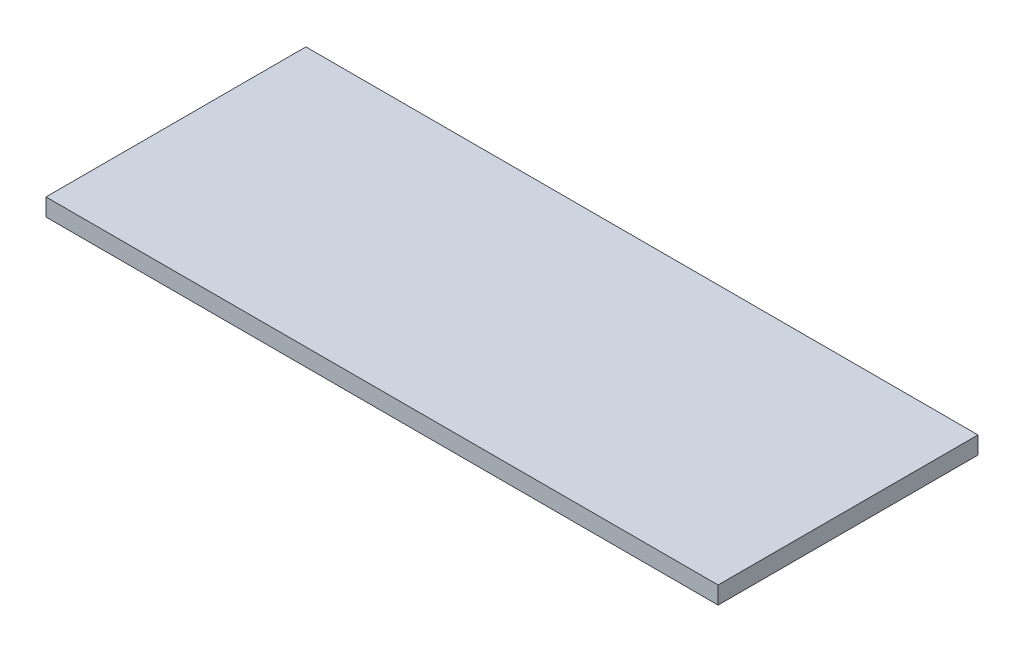
ISO-10303-21;
HEADER;
FILE_DESCRIPTION(('STEP AP214'),'2;1');
FILE_NAME('part.step','',(''),(''),'','','');
FILE_SCHEMA(('AUTOMOTIVE_DESIGN { 1 0 10303 214 1 1 1 1 }'));
ENDSEC;
DATA;
#1=APPLICATION_CONTEXT('core data for automotive mechanical design processes');
#2=APPLICATION_PROTOCOL_DEFINITION('international standard','automotive_design',2000,#1);
#3=PRODUCT_CONTEXT('',#1,'mechanical');
#4=PRODUCT('Part','Part','',(#3));
#5=PRODUCT_RELATED_PRODUCT_CATEGORY('part','',(#4));
#6=PRODUCT_DEFINITION_FORMATION('','',#4);
#7=PRODUCT_DEFINITION_CONTEXT('part definition',#1,'design');
#8=PRODUCT_DEFINITION('design','',#6,#7);
#9=PRODUCT_DEFINITION_SHAPE('','',#8);
#10=(LENGTH_UNIT() NAMED_UNIT(*) SI_UNIT(.MILLI.,.METRE.));
#11=(NAMED_UNIT(*) PLANE_ANGLE_UNIT() SI_UNIT($,.RADIAN.));
#12=(NAMED_UNIT(*) SI_UNIT($,.STERADIAN.) SOLID_ANGLE_UNIT());
#13=UNCERTAINTY_MEASURE_WITH_UNIT(LENGTH_MEASURE(1.E-05),#10,'distance_accuracy_value','');
#14=(GEOMETRIC_REPRESENTATION_CONTEXT(3) GLOBAL_UNCERTAINTY_ASSIGNED_CONTEXT((#13)) GLOBAL_UNIT_ASSIGNED_CONTEXT((#10,
#11,#12)) REPRESENTATION_CONTEXT('',''));
#15=CARTESIAN_POINT('',(0.,0.,0.));
#16=DIRECTION('',(0.,0.,1.));
#17=DIRECTION('',(1.,0.,0.));
#18=AXIS2_PLACEMENT_3D('',#15,#16,#17);
#19=CARTESIAN_POINT('',(-66.205,3.44,-25.6));
#20=DIRECTION('',(1.,0.,0.));
#21=DIRECTION('',(0.,0.,-1.));
#22=AXIS2_PLACEMENT_3D('',#19,#20,#21);
#23=PLANE('',#22);
#24=DIRECTION('',(0.,0.,1.));
#25=VECTOR('',#24,1.);
#26=CARTESIAN_POINT('',(-66.205,0.,-25.6));
#27=LINE('',#26,#25);
#28=CARTESIAN_POINT('',(-66.205,0.,-25.6));
#29=VERTEX_POINT('',#28);
#30=CARTESIAN_POINT('',(-66.205,0.,25.6));
#31=VERTEX_POINT('',#30);
#32=EDGE_CURVE('E111',#29,#31,#27,.T.);
#33=ORIENTED_EDGE('',*,*,#32,.T.);
#34=DIRECTION('',(0.,-1.,0.));
#35=VECTOR('',#34,1.);
#36=CARTESIAN_POINT('',(-66.205,3.44,25.6));
#37=LINE('',#36,#35);
#38=CARTESIAN_POINT('',(-66.205,3.44,25.6));
#39=VERTEX_POINT('',#38);
#40=EDGE_CURVE('E11',#39,#31,#37,.T.);
#41=ORIENTED_EDGE('',*,*,#40,.F.);
#42=DIRECTION('',(0.,0.,1.));
#43=VECTOR('',#42,1.);
#44=CARTESIAN_POINT('',(-66.205,3.44,-25.6));
#45=LINE('',#44,#43);
#46=CARTESIAN_POINT('',(-66.205,3.44,-25.6));
#47=VERTEX_POINT('',#46);
#48=EDGE_CURVE('E95',#47,#39,#45,.T.);
#49=ORIENTED_EDGE('',*,*,#48,.F.);
#50=DIRECTION('',(0.,-1.,0.));
#51=VECTOR('',#50,1.);
#52=CARTESIAN_POINT('',(-66.205,3.44,-25.6));
#53=LINE('',#52,#51);
#54=EDGE_CURVE('E107',#47,#29,#53,.T.);
#55=ORIENTED_EDGE('',*,*,#54,.T.);
#56=EDGE_LOOP('',(#33,#41,#49,#55));
#57=FACE_BOUND('',#56,.T.);
#58=ADVANCED_FACE('F43',(#57),#23,.F.);
#59=CARTESIAN_POINT('',(66.205,3.44,25.6));
#60=DIRECTION('',(0.,0.,-1.));
#61=DIRECTION('',(-1.,0.,0.));
#62=AXIS2_PLACEMENT_3D('',#59,#60,#61);
#63=PLANE('',#62);
#64=DIRECTION('',(1.,0.,0.));
#65=VECTOR('',#64,1.);
#66=CARTESIAN_POINT('',(66.205,0.,25.6));
#67=LINE('',#66,#65);
#68=CARTESIAN_POINT('',(66.205,0.,25.6));
#69=VERTEX_POINT('',#68);
#70=EDGE_CURVE('E100',#31,#69,#67,.T.);
#71=ORIENTED_EDGE('',*,*,#70,.T.);
#72=DIRECTION('',(0.,-1.,0.));
#73=VECTOR('',#72,1.);
#74=CARTESIAN_POINT('',(66.205,3.44,25.6));
#75=LINE('',#74,#73);
#76=CARTESIAN_POINT('',(66.205,3.44,25.6));
#77=VERTEX_POINT('',#76);
#78=EDGE_CURVE('E52',#77,#69,#75,.T.);
#79=ORIENTED_EDGE('',*,*,#78,.F.);
#80=DIRECTION('',(1.,0.,0.));
#81=VECTOR('',#80,1.);
#82=CARTESIAN_POINT('',(66.205,3.44,25.6));
#83=LINE('',#82,#81);
#84=EDGE_CURVE('E90',#39,#77,#83,.T.);
#85=ORIENTED_EDGE('',*,*,#84,.F.);
#86=ORIENTED_EDGE('',*,*,#40,.T.);
#87=EDGE_LOOP('',(#71,#79,#85,#86));
#88=FACE_BOUND('',#87,.T.);
#89=ADVANCED_FACE('F99',(#88),#63,.F.);
#90=CARTESIAN_POINT('',(66.205,3.44,-25.6));
#91=DIRECTION('',(-1.,0.,0.));
#92=DIRECTION('',(0.,0.,1.));
#93=AXIS2_PLACEMENT_3D('',#90,#91,#92);
#94=PLANE('',#93);
#95=DIRECTION('',(0.,0.,-1.));
#96=VECTOR('',#95,1.);
#97=CARTESIAN_POINT('',(66.205,0.,-25.6));
#98=LINE('',#97,#96);
#99=CARTESIAN_POINT('',(66.205,0.,-25.6));
#100=VERTEX_POINT('',#99);
#101=EDGE_CURVE('E77',#69,#100,#98,.T.);
#102=ORIENTED_EDGE('',*,*,#101,.T.);
#103=DIRECTION('',(0.,-1.,0.));
#104=VECTOR('',#103,1.);
#105=CARTESIAN_POINT('',(66.205,3.44,-25.6));
#106=LINE('',#105,#104);
#107=CARTESIAN_POINT('',(66.205,3.44,-25.6));
#108=VERTEX_POINT('',#107);
#109=EDGE_CURVE('E102',#108,#100,#106,.T.);
#110=ORIENTED_EDGE('',*,*,#109,.F.);
#111=DIRECTION('',(0.,0.,-1.));
#112=VECTOR('',#111,1.);
#113=CARTESIAN_POINT('',(66.205,3.44,-25.6));
#114=LINE('',#113,#112);
#115=EDGE_CURVE('E93',#77,#108,#114,.T.);
#116=ORIENTED_EDGE('',*,*,#115,.F.);
#117=ORIENTED_EDGE('',*,*,#78,.T.);
#118=EDGE_LOOP('',(#102,#110,#116,#117));
#119=FACE_BOUND('',#118,.T.);
#120=ADVANCED_FACE('F103',(#119),#94,.F.);
#121=CARTESIAN_POINT('',(66.205,3.44,-25.6));
#122=DIRECTION('',(0.,0.,1.));
#123=DIRECTION('',(1.,0.,0.));
#124=AXIS2_PLACEMENT_3D('',#121,#122,#123);
#125=PLANE('',#124);
#126=DIRECTION('',(-1.,0.,0.));
#127=VECTOR('',#126,1.);
#128=CARTESIAN_POINT('',(66.205,0.,-25.6));
#129=LINE('',#128,#127);
#130=EDGE_CURVE('E83',#100,#29,#129,.T.);
#131=ORIENTED_EDGE('',*,*,#130,.T.);
#132=ORIENTED_EDGE('',*,*,#54,.F.);
#133=DIRECTION('',(-1.,0.,0.));
#134=VECTOR('',#133,1.);
#135=CARTESIAN_POINT('',(66.205,3.44,-25.6));
#136=LINE('',#135,#134);
#137=EDGE_CURVE('E60',#108,#47,#136,.T.);
#138=ORIENTED_EDGE('',*,*,#137,.F.);
#139=ORIENTED_EDGE('',*,*,#109,.T.);
#140=EDGE_LOOP('',(#131,#132,#138,#139));
#141=FACE_BOUND('',#140,.T.);
#142=ADVANCED_FACE('F124',(#141),#125,.F.);
#143=CARTESIAN_POINT('',(0.,3.44,0.));
#144=DIRECTION('',(0.,-1.,0.));
#145=DIRECTION('',(0.,0.,-1.));
#146=AXIS2_PLACEMENT_3D('',#143,#144,#145);
#147=PLANE('',#146);
#148=ORIENTED_EDGE('',*,*,#48,.T.);
#149=ORIENTED_EDGE('',*,*,#84,.T.);
#150=ORIENTED_EDGE('',*,*,#115,.T.);
#151=ORIENTED_EDGE('',*,*,#137,.T.);
#152=EDGE_LOOP('',(#148,#149,#150,#151));
#153=FACE_BOUND('',#152,.T.);
#154=ADVANCED_FACE('F91',(#153),#147,.F.);
#155=CARTESIAN_POINT('',(0.,0.,0.));
#156=DIRECTION('',(0.,-1.,0.));
#157=DIRECTION('',(0.,0.,-1.));
#158=AXIS2_PLACEMENT_3D('',#155,#156,#157);
#159=PLANE('',#158);
#160=ORIENTED_EDGE('',*,*,#32,.F.);
#161=ORIENTED_EDGE('',*,*,#130,.F.);
#162=ORIENTED_EDGE('',*,*,#101,.F.);
#163=ORIENTED_EDGE('',*,*,#70,.F.);
#164=EDGE_LOOP('',(#160,#161,#162,#163));
#165=FACE_BOUND('',#164,.T.);
#166=ADVANCED_FACE('F127',(#165),#159,.T.);
#167=CLOSED_SHELL('',(#58,#89,#120,#142,#154,#166));
#168=MANIFOLD_SOLID_BREP('B2',#167);
#169=ADVANCED_BREP_SHAPE_REPRESENTATION('',(#18,#168),#14);
#170=SHAPE_DEFINITION_REPRESENTATION(#9,#169);
ENDSEC;
END-ISO-10303-21;
